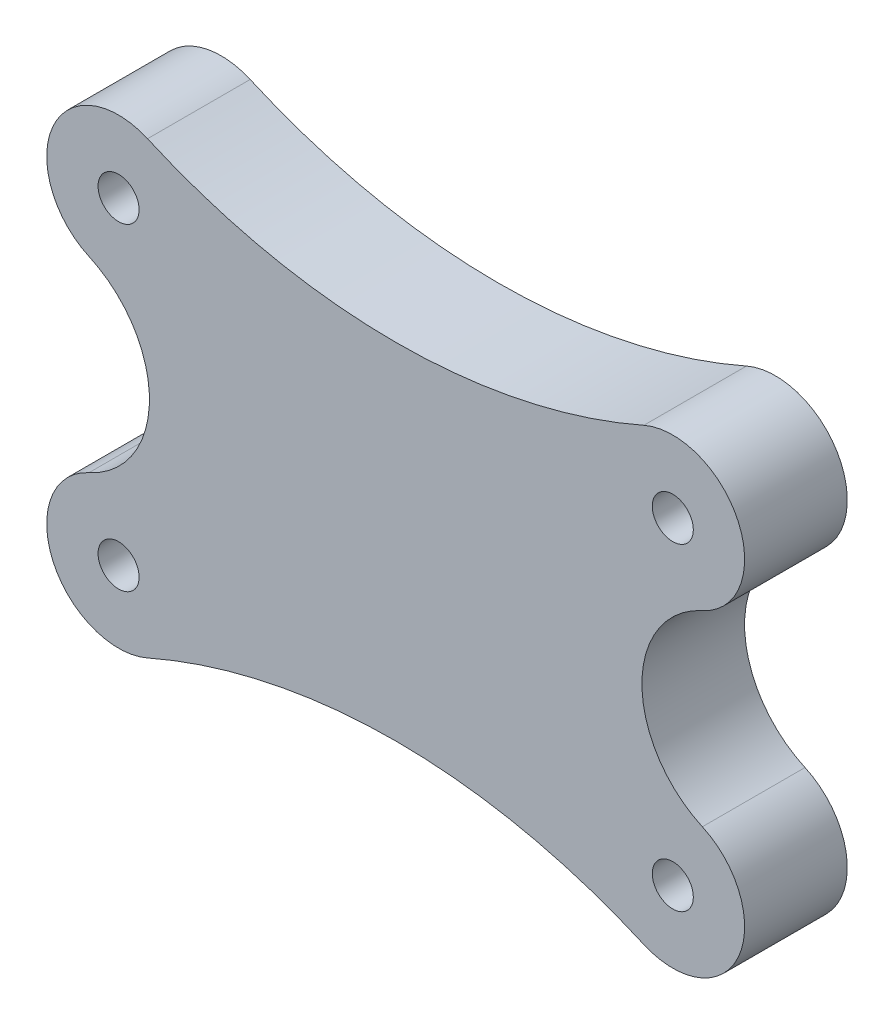
ISO-10303-21;
HEADER;
FILE_DESCRIPTION(('STEP AP214'),'2;1');
FILE_NAME('part.step','',(''),(''),'','','');
FILE_SCHEMA(('AUTOMOTIVE_DESIGN { 1 0 10303 214 1 1 1 1 }'));
ENDSEC;
DATA;
#1=APPLICATION_CONTEXT('core data for automotive mechanical design processes');
#2=APPLICATION_PROTOCOL_DEFINITION('international standard','automotive_design',2000,#1);
#3=PRODUCT_CONTEXT('',#1,'mechanical');
#4=PRODUCT('Part','Part','',(#3));
#5=PRODUCT_RELATED_PRODUCT_CATEGORY('part','',(#4));
#6=PRODUCT_DEFINITION_FORMATION('','',#4);
#7=PRODUCT_DEFINITION_CONTEXT('part definition',#1,'design');
#8=PRODUCT_DEFINITION('design','',#6,#7);
#9=PRODUCT_DEFINITION_SHAPE('','',#8);
#10=(LENGTH_UNIT() NAMED_UNIT(*) SI_UNIT(.MILLI.,.METRE.));
#11=(NAMED_UNIT(*) PLANE_ANGLE_UNIT() SI_UNIT($,.RADIAN.));
#12=(NAMED_UNIT(*) SI_UNIT($,.STERADIAN.) SOLID_ANGLE_UNIT());
#13=UNCERTAINTY_MEASURE_WITH_UNIT(LENGTH_MEASURE(1.E-05),#10,'distance_accuracy_value','');
#14=(GEOMETRIC_REPRESENTATION_CONTEXT(3) GLOBAL_UNCERTAINTY_ASSIGNED_CONTEXT((#13)) GLOBAL_UNIT_ASSIGNED_CONTEXT((#10,
#11,#12)) REPRESENTATION_CONTEXT('',''));
#15=CARTESIAN_POINT('',(0.,0.,0.));
#16=DIRECTION('',(0.,0.,1.));
#17=DIRECTION('',(1.,0.,0.));
#18=AXIS2_PLACEMENT_3D('',#15,#16,#17);
#19=CARTESIAN_POINT('',(0.,0.,5.));
#20=DIRECTION('',(0.,0.,1.));
#21=DIRECTION('',(1.,0.,0.));
#22=AXIS2_PLACEMENT_3D('',#19,#20,#21);
#23=PLANE('',#22);
#24=CARTESIAN_POINT('',(-3.5,3.49999999999999,5.));
#25=DIRECTION('',(0.,0.,1.));
#26=DIRECTION('',(1.,0.,0.));
#27=AXIS2_PLACEMENT_3D('',#24,#25,#26);
#28=CIRCLE('',#27,1.);
#29=CARTESIAN_POINT('',(-2.49999999999999,3.49999999999999,5.));
#30=VERTEX_POINT('',#29);
#31=EDGE_CURVE('E167',#30,#30,#28,.F.);
#32=ORIENTED_EDGE('',*,*,#31,.T.);
#33=EDGE_LOOP('',(#32));
#34=FACE_BOUND('',#33,.T.);
#35=CARTESIAN_POINT('',(-3.5,19.,5.));
#36=DIRECTION('',(0.,0.,1.));
#37=DIRECTION('',(1.,0.,0.));
#38=AXIS2_PLACEMENT_3D('',#35,#36,#37);
#39=CIRCLE('',#38,1.);
#40=CARTESIAN_POINT('',(-2.5,19.,5.));
#41=VERTEX_POINT('',#40);
#42=EDGE_CURVE('E170',#41,#41,#39,.T.);
#43=ORIENTED_EDGE('',*,*,#42,.F.);
#44=EDGE_LOOP('',(#43));
#45=FACE_BOUND('',#44,.T.);
#46=CARTESIAN_POINT('',(-30.5,19.,5.));
#47=DIRECTION('',(0.,0.,1.));
#48=DIRECTION('',(1.,0.,0.));
#49=AXIS2_PLACEMENT_3D('',#46,#47,#48);
#50=CIRCLE('',#49,0.999999999999998);
#51=CARTESIAN_POINT('',(-29.5,19.,5.));
#52=VERTEX_POINT('',#51);
#53=EDGE_CURVE('E174',#52,#52,#50,.T.);
#54=ORIENTED_EDGE('',*,*,#53,.F.);
#55=EDGE_LOOP('',(#54));
#56=FACE_BOUND('',#55,.T.);
#57=CARTESIAN_POINT('',(-30.5,3.49999999999999,5.));
#58=DIRECTION('',(0.,0.,1.));
#59=DIRECTION('',(1.,0.,0.));
#60=AXIS2_PLACEMENT_3D('',#57,#58,#59);
#61=CIRCLE('',#60,0.999999999999998);
#62=CARTESIAN_POINT('',(-29.5,3.49999999999999,5.));
#63=VERTEX_POINT('',#62);
#64=EDGE_CURVE('E112',#63,#63,#61,.F.);
#65=ORIENTED_EDGE('',*,*,#64,.T.);
#66=EDGE_LOOP('',(#65));
#67=FACE_BOUND('',#66,.T.);
#68=CARTESIAN_POINT('',(-30.5,3.49999999999999,5.));
#69=DIRECTION('',(0.,0.,1.));
#70=DIRECTION('',(1.,0.,0.));
#71=AXIS2_PLACEMENT_3D('',#68,#69,#70);
#72=CIRCLE('',#71,3.49999999999999);
#73=CARTESIAN_POINT('',(-31.9405535284927,6.68979709880534,5.));
#74=VERTEX_POINT('',#73);
#75=CARTESIAN_POINT('',(-29.089552238806,0.296777074110705,5.));
#76=VERTEX_POINT('',#75);
#77=EDGE_CURVE('E51',#74,#76,#72,.T.);
#78=ORIENTED_EDGE('',*,*,#77,.T.);
#79=CARTESIAN_POINT('',(-17.,-27.1594194335118,5.));
#80=DIRECTION('',(0.,0.,1.));
#81=DIRECTION('',(1.,0.,0.));
#82=AXIS2_PLACEMENT_3D('',#79,#80,#81);
#83=CIRCLE('',#82,30.);
#84=CARTESIAN_POINT('',(-4.91044776119402,0.296777074110709,5.));
#85=VERTEX_POINT('',#84);
#86=EDGE_CURVE('E164',#76,#85,#83,.F.);
#87=ORIENTED_EDGE('',*,*,#86,.T.);
#88=CARTESIAN_POINT('',(-3.5,3.49999999999999,5.));
#89=DIRECTION('',(0.,0.,1.));
#90=DIRECTION('',(1.,0.,0.));
#91=AXIS2_PLACEMENT_3D('',#88,#89,#90);
#92=CIRCLE('',#91,3.49999999999999);
#93=CARTESIAN_POINT('',(-2.05944647150726,6.68979709880535,5.));
#94=VERTEX_POINT('',#93);
#95=EDGE_CURVE('E59',#85,#94,#92,.T.);
#96=ORIENTED_EDGE('',*,*,#95,.T.);
#97=CARTESIAN_POINT('',(0.,11.25,5.));
#98=DIRECTION('',(0.,0.,1.));
#99=DIRECTION('',(1.,0.,0.));
#100=AXIS2_PLACEMENT_3D('',#97,#98,#99);
#101=CIRCLE('',#100,5.00367567584748);
#102=CARTESIAN_POINT('',(-2.05944647150726,15.8102029011946,5.));
#103=VERTEX_POINT('',#102);
#104=EDGE_CURVE('E160',#94,#103,#101,.F.);
#105=ORIENTED_EDGE('',*,*,#104,.T.);
#106=CARTESIAN_POINT('',(-3.5,19.,5.));
#107=DIRECTION('',(0.,0.,1.));
#108=DIRECTION('',(1.,0.,0.));
#109=AXIS2_PLACEMENT_3D('',#106,#107,#108);
#110=CIRCLE('',#109,3.5);
#111=CARTESIAN_POINT('',(-4.91044776119403,22.2032229258893,5.));
#112=VERTEX_POINT('',#111);
#113=EDGE_CURVE('E158',#103,#112,#110,.T.);
#114=ORIENTED_EDGE('',*,*,#113,.T.);
#115=CARTESIAN_POINT('',(-17.,49.6594194335118,5.));
#116=DIRECTION('',(0.,0.,1.));
#117=DIRECTION('',(1.,0.,0.));
#118=AXIS2_PLACEMENT_3D('',#115,#116,#117);
#119=CIRCLE('',#118,30.);
#120=CARTESIAN_POINT('',(-29.089552238806,22.2032229258893,5.));
#121=VERTEX_POINT('',#120);
#122=EDGE_CURVE('E155',#112,#121,#119,.F.);
#123=ORIENTED_EDGE('',*,*,#122,.T.);
#124=CARTESIAN_POINT('',(-30.5,19.,5.));
#125=DIRECTION('',(0.,0.,1.));
#126=DIRECTION('',(1.,0.,0.));
#127=AXIS2_PLACEMENT_3D('',#124,#125,#126);
#128=CIRCLE('',#127,3.49999999999998);
#129=CARTESIAN_POINT('',(-31.9405535284927,15.8102029011946,5.));
#130=VERTEX_POINT('',#129);
#131=EDGE_CURVE('E152',#121,#130,#128,.T.);
#132=ORIENTED_EDGE('',*,*,#131,.T.);
#133=CARTESIAN_POINT('',(-34.,11.25,5.));
#134=DIRECTION('',(0.,0.,1.));
#135=DIRECTION('',(1.,0.,0.));
#136=AXIS2_PLACEMENT_3D('',#133,#134,#135);
#137=CIRCLE('',#136,5.00367567584749);
#138=EDGE_CURVE('E150',#130,#74,#137,.F.);
#139=ORIENTED_EDGE('',*,*,#138,.T.);
#140=EDGE_LOOP('',(#78,#87,#96,#105,#114,#123,#132,#139));
#141=FACE_BOUND('',#140,.T.);
#142=ADVANCED_FACE('F36',(#34,#45,#56,#67,#141),#23,.T.);
#143=CARTESIAN_POINT('',(0.,0.,0.));
#144=DIRECTION('',(0.,0.,1.));
#145=DIRECTION('',(1.,0.,0.));
#146=AXIS2_PLACEMENT_3D('',#143,#144,#145);
#147=PLANE('',#146);
#148=CARTESIAN_POINT('',(-3.5,3.49999999999999,0.));
#149=DIRECTION('',(0.,0.,1.));
#150=DIRECTION('',(1.,0.,0.));
#151=AXIS2_PLACEMENT_3D('',#148,#149,#150);
#152=CIRCLE('',#151,1.);
#153=CARTESIAN_POINT('',(-2.49999999999999,3.49999999999999,0.));
#154=VERTEX_POINT('',#153);
#155=EDGE_CURVE('E166',#154,#154,#152,.F.);
#156=ORIENTED_EDGE('',*,*,#155,.F.);
#157=EDGE_LOOP('',(#156));
#158=FACE_BOUND('',#157,.T.);
#159=CARTESIAN_POINT('',(-3.5,19.,0.));
#160=DIRECTION('',(0.,0.,1.));
#161=DIRECTION('',(1.,0.,0.));
#162=AXIS2_PLACEMENT_3D('',#159,#160,#161);
#163=CIRCLE('',#162,1.);
#164=CARTESIAN_POINT('',(-2.5,19.,0.));
#165=VERTEX_POINT('',#164);
#166=EDGE_CURVE('E181',#165,#165,#163,.T.);
#167=ORIENTED_EDGE('',*,*,#166,.T.);
#168=EDGE_LOOP('',(#167));
#169=FACE_BOUND('',#168,.T.);
#170=CARTESIAN_POINT('',(-30.5,19.,0.));
#171=DIRECTION('',(0.,0.,1.));
#172=DIRECTION('',(1.,0.,0.));
#173=AXIS2_PLACEMENT_3D('',#170,#171,#172);
#174=CIRCLE('',#173,0.999999999999998);
#175=CARTESIAN_POINT('',(-29.5,19.,0.));
#176=VERTEX_POINT('',#175);
#177=EDGE_CURVE('E184',#176,#176,#174,.T.);
#178=ORIENTED_EDGE('',*,*,#177,.T.);
#179=EDGE_LOOP('',(#178));
#180=FACE_BOUND('',#179,.T.);
#181=CARTESIAN_POINT('',(-30.5,3.49999999999999,0.));
#182=DIRECTION('',(0.,0.,1.));
#183=DIRECTION('',(1.,0.,0.));
#184=AXIS2_PLACEMENT_3D('',#181,#182,#183);
#185=CIRCLE('',#184,0.999999999999998);
#186=CARTESIAN_POINT('',(-29.5,3.49999999999999,0.));
#187=VERTEX_POINT('',#186);
#188=EDGE_CURVE('E171',#187,#187,#185,.F.);
#189=ORIENTED_EDGE('',*,*,#188,.F.);
#190=EDGE_LOOP('',(#189));
#191=FACE_BOUND('',#190,.T.);
#192=CARTESIAN_POINT('',(-17.,-27.1594194335118,0.));
#193=DIRECTION('',(0.,0.,1.));
#194=DIRECTION('',(-1.,0.,0.));
#195=AXIS2_PLACEMENT_3D('',#192,#193,#194);
#196=CIRCLE('',#195,30.);
#197=CARTESIAN_POINT('',(-4.91044776119402,0.296777074110709,0.));
#198=VERTEX_POINT('',#197);
#199=CARTESIAN_POINT('',(-29.089552238806,0.296777074110705,0.));
#200=VERTEX_POINT('',#199);
#201=EDGE_CURVE('E108',#198,#200,#196,.T.);
#202=ORIENTED_EDGE('',*,*,#201,.T.);
#203=CARTESIAN_POINT('',(-30.5,3.49999999999999,0.));
#204=DIRECTION('',(0.,0.,1.));
#205=DIRECTION('',(1.,0.,0.));
#206=AXIS2_PLACEMENT_3D('',#203,#204,#205);
#207=CIRCLE('',#206,3.49999999999999);
#208=CARTESIAN_POINT('',(-31.9405535284927,6.68979709880534,0.));
#209=VERTEX_POINT('',#208);
#210=EDGE_CURVE('E102',#209,#200,#207,.T.);
#211=ORIENTED_EDGE('',*,*,#210,.F.);
#212=CARTESIAN_POINT('',(-34.,11.25,0.));
#213=DIRECTION('',(0.,0.,1.));
#214=DIRECTION('',(-1.,0.,0.));
#215=AXIS2_PLACEMENT_3D('',#212,#213,#214);
#216=CIRCLE('',#215,5.00367567584749);
#217=CARTESIAN_POINT('',(-31.9405535284927,15.8102029011946,0.));
#218=VERTEX_POINT('',#217);
#219=EDGE_CURVE('E106',#209,#218,#216,.T.);
#220=ORIENTED_EDGE('',*,*,#219,.T.);
#221=CARTESIAN_POINT('',(-30.5,19.,0.));
#222=DIRECTION('',(0.,0.,1.));
#223=DIRECTION('',(1.,0.,0.));
#224=AXIS2_PLACEMENT_3D('',#221,#222,#223);
#225=CIRCLE('',#224,3.49999999999998);
#226=CARTESIAN_POINT('',(-29.089552238806,22.2032229258893,0.));
#227=VERTEX_POINT('',#226);
#228=EDGE_CURVE('E111',#227,#218,#225,.T.);
#229=ORIENTED_EDGE('',*,*,#228,.F.);
#230=CARTESIAN_POINT('',(-17.,49.6594194335118,0.));
#231=DIRECTION('',(0.,0.,1.));
#232=DIRECTION('',(1.,0.,0.));
#233=AXIS2_PLACEMENT_3D('',#230,#231,#232);
#234=CIRCLE('',#233,30.);
#235=CARTESIAN_POINT('',(-4.91044776119403,22.2032229258893,0.));
#236=VERTEX_POINT('',#235);
#237=EDGE_CURVE('E124',#227,#236,#234,.T.);
#238=ORIENTED_EDGE('',*,*,#237,.T.);
#239=CARTESIAN_POINT('',(-3.5,19.,0.));
#240=DIRECTION('',(0.,0.,1.));
#241=DIRECTION('',(1.,0.,0.));
#242=AXIS2_PLACEMENT_3D('',#239,#240,#241);
#243=CIRCLE('',#242,3.5);
#244=CARTESIAN_POINT('',(-2.05944647150726,15.8102029011946,0.));
#245=VERTEX_POINT('',#244);
#246=EDGE_CURVE('E44',#245,#236,#243,.T.);
#247=ORIENTED_EDGE('',*,*,#246,.F.);
#248=CARTESIAN_POINT('',(0.,11.25,0.));
#249=DIRECTION('',(0.,0.,1.));
#250=DIRECTION('',(-1.,0.,0.));
#251=AXIS2_PLACEMENT_3D('',#248,#249,#250);
#252=CIRCLE('',#251,5.00367567584748);
#253=CARTESIAN_POINT('',(-2.05944647150726,6.68979709880535,0.));
#254=VERTEX_POINT('',#253);
#255=EDGE_CURVE('E127',#245,#254,#252,.T.);
#256=ORIENTED_EDGE('',*,*,#255,.T.);
#257=CARTESIAN_POINT('',(-3.5,3.49999999999999,0.));
#258=DIRECTION('',(0.,0.,1.));
#259=DIRECTION('',(1.,0.,0.));
#260=AXIS2_PLACEMENT_3D('',#257,#258,#259);
#261=CIRCLE('',#260,3.49999999999999);
#262=EDGE_CURVE('E11',#198,#254,#261,.T.);
#263=ORIENTED_EDGE('',*,*,#262,.F.);
#264=EDGE_LOOP('',(#202,#211,#220,#229,#238,#247,#256,#263));
#265=FACE_BOUND('',#264,.T.);
#266=ADVANCED_FACE('F104',(#158,#169,#180,#191,#265),#147,.F.);
#267=CARTESIAN_POINT('',(-30.5,19.,5.));
#268=DIRECTION('',(0.,0.,-1.));
#269=DIRECTION('',(-1.,0.,0.));
#270=AXIS2_PLACEMENT_3D('',#267,#268,#269);
#271=CYLINDRICAL_SURFACE('',#270,0.999999999999998);
#272=ORIENTED_EDGE('',*,*,#53,.T.);
#273=EDGE_LOOP('',(#272));
#274=FACE_BOUND('',#273,.T.);
#275=ORIENTED_EDGE('',*,*,#177,.F.);
#276=EDGE_LOOP('',(#275));
#277=FACE_BOUND('',#276,.T.);
#278=ADVANCED_FACE('F222',(#274,#277),#271,.F.);
#279=CARTESIAN_POINT('',(-3.5,19.,5.));
#280=DIRECTION('',(0.,0.,-1.));
#281=DIRECTION('',(-1.,0.,0.));
#282=AXIS2_PLACEMENT_3D('',#279,#280,#281);
#283=CYLINDRICAL_SURFACE('',#282,1.);
#284=ORIENTED_EDGE('',*,*,#42,.T.);
#285=EDGE_LOOP('',(#284));
#286=FACE_BOUND('',#285,.T.);
#287=ORIENTED_EDGE('',*,*,#166,.F.);
#288=EDGE_LOOP('',(#287));
#289=FACE_BOUND('',#288,.T.);
#290=ADVANCED_FACE('F232',(#286,#289),#283,.F.);
#291=CARTESIAN_POINT('',(-3.5,3.49999999999999,5.));
#292=DIRECTION('',(0.,0.,-1.));
#293=DIRECTION('',(-1.,0.,0.));
#294=AXIS2_PLACEMENT_3D('',#291,#292,#293);
#295=CYLINDRICAL_SURFACE('',#294,1.);
#296=ORIENTED_EDGE('',*,*,#31,.F.);
#297=EDGE_LOOP('',(#296));
#298=FACE_BOUND('',#297,.T.);
#299=ORIENTED_EDGE('',*,*,#155,.T.);
#300=EDGE_LOOP('',(#299));
#301=FACE_BOUND('',#300,.T.);
#302=ADVANCED_FACE('F38',(#298,#301),#295,.F.);
#303=CARTESIAN_POINT('',(-30.5,3.49999999999999,5.));
#304=DIRECTION('',(0.,0.,-1.));
#305=DIRECTION('',(-1.,0.,0.));
#306=AXIS2_PLACEMENT_3D('',#303,#304,#305);
#307=CYLINDRICAL_SURFACE('',#306,0.999999999999998);
#308=ORIENTED_EDGE('',*,*,#64,.F.);
#309=EDGE_LOOP('',(#308));
#310=FACE_BOUND('',#309,.T.);
#311=ORIENTED_EDGE('',*,*,#188,.T.);
#312=EDGE_LOOP('',(#311));
#313=FACE_BOUND('',#312,.T.);
#314=ADVANCED_FACE('F227',(#310,#313),#307,.F.);
#315=CARTESIAN_POINT('',(-3.5,3.49999999999999,10.));
#316=DIRECTION('',(0.,0.,-1.));
#317=DIRECTION('',(-1.,0.,0.));
#318=AXIS2_PLACEMENT_3D('',#315,#316,#317);
#319=CYLINDRICAL_SURFACE('',#318,3.49999999999999);
#320=ORIENTED_EDGE('',*,*,#95,.F.);
#321=DIRECTION('',(0.,0.,-1.));
#322=VECTOR('',#321,1.);
#323=CARTESIAN_POINT('',(-4.91044776119402,0.296777074110709,10.));
#324=LINE('',#323,#322);
#325=EDGE_CURVE('E133',#85,#198,#324,.T.);
#326=ORIENTED_EDGE('',*,*,#325,.T.);
#327=ORIENTED_EDGE('',*,*,#262,.T.);
#328=DIRECTION('',(0.,0.,-1.));
#329=VECTOR('',#328,1.);
#330=CARTESIAN_POINT('',(-2.05944647150726,6.68979709880535,10.));
#331=LINE('',#330,#329);
#332=EDGE_CURVE('E135',#94,#254,#331,.T.);
#333=ORIENTED_EDGE('',*,*,#332,.F.);
#334=EDGE_LOOP('',(#320,#326,#327,#333));
#335=FACE_BOUND('',#334,.T.);
#336=ADVANCED_FACE('F204',(#335),#319,.T.);
#337=CARTESIAN_POINT('',(-3.5,19.,10.));
#338=DIRECTION('',(0.,0.,-1.));
#339=DIRECTION('',(-1.,0.,0.));
#340=AXIS2_PLACEMENT_3D('',#337,#338,#339);
#341=CYLINDRICAL_SURFACE('',#340,3.5);
#342=ORIENTED_EDGE('',*,*,#113,.F.);
#343=DIRECTION('',(0.,0.,-1.));
#344=VECTOR('',#343,1.);
#345=CARTESIAN_POINT('',(-2.05944647150726,15.8102029011946,10.));
#346=LINE('',#345,#344);
#347=EDGE_CURVE('E138',#103,#245,#346,.T.);
#348=ORIENTED_EDGE('',*,*,#347,.T.);
#349=ORIENTED_EDGE('',*,*,#246,.T.);
#350=DIRECTION('',(0.,0.,-1.));
#351=VECTOR('',#350,1.);
#352=CARTESIAN_POINT('',(-4.91044776119403,22.2032229258893,10.));
#353=LINE('',#352,#351);
#354=EDGE_CURVE('E141',#112,#236,#353,.T.);
#355=ORIENTED_EDGE('',*,*,#354,.F.);
#356=EDGE_LOOP('',(#342,#348,#349,#355));
#357=FACE_BOUND('',#356,.T.);
#358=ADVANCED_FACE('F191',(#357),#341,.T.);
#359=CARTESIAN_POINT('',(-30.5,19.,10.));
#360=DIRECTION('',(0.,0.,-1.));
#361=DIRECTION('',(-1.,0.,0.));
#362=AXIS2_PLACEMENT_3D('',#359,#360,#361);
#363=CYLINDRICAL_SURFACE('',#362,3.49999999999998);
#364=ORIENTED_EDGE('',*,*,#131,.F.);
#365=DIRECTION('',(0.,0.,-1.));
#366=VECTOR('',#365,1.);
#367=CARTESIAN_POINT('',(-29.089552238806,22.2032229258893,10.));
#368=LINE('',#367,#366);
#369=EDGE_CURVE('E144',#121,#227,#368,.T.);
#370=ORIENTED_EDGE('',*,*,#369,.T.);
#371=ORIENTED_EDGE('',*,*,#228,.T.);
#372=DIRECTION('',(0.,0.,-1.));
#373=VECTOR('',#372,1.);
#374=CARTESIAN_POINT('',(-31.9405535284927,15.8102029011946,10.));
#375=LINE('',#374,#373);
#376=EDGE_CURVE('E118',#130,#218,#375,.T.);
#377=ORIENTED_EDGE('',*,*,#376,.F.);
#378=EDGE_LOOP('',(#364,#370,#371,#377));
#379=FACE_BOUND('',#378,.T.);
#380=ADVANCED_FACE('F200',(#379),#363,.T.);
#381=CARTESIAN_POINT('',(-30.5,3.49999999999999,10.));
#382=DIRECTION('',(0.,0.,-1.));
#383=DIRECTION('',(-1.,0.,0.));
#384=AXIS2_PLACEMENT_3D('',#381,#382,#383);
#385=CYLINDRICAL_SURFACE('',#384,3.49999999999999);
#386=ORIENTED_EDGE('',*,*,#77,.F.);
#387=DIRECTION('',(0.,0.,-1.));
#388=VECTOR('',#387,1.);
#389=CARTESIAN_POINT('',(-31.9405535284927,6.68979709880534,10.));
#390=LINE('',#389,#388);
#391=EDGE_CURVE('E115',#74,#209,#390,.T.);
#392=ORIENTED_EDGE('',*,*,#391,.T.);
#393=ORIENTED_EDGE('',*,*,#210,.T.);
#394=DIRECTION('',(0.,0.,-1.));
#395=VECTOR('',#394,1.);
#396=CARTESIAN_POINT('',(-29.089552238806,0.296777074110705,10.));
#397=LINE('',#396,#395);
#398=EDGE_CURVE('E119',#76,#200,#397,.T.);
#399=ORIENTED_EDGE('',*,*,#398,.F.);
#400=EDGE_LOOP('',(#386,#392,#393,#399));
#401=FACE_BOUND('',#400,.T.);
#402=ADVANCED_FACE('F116',(#401),#385,.T.);
#403=CARTESIAN_POINT('',(-17.,-27.1594194335118,10.));
#404=DIRECTION('',(0.,0.,-1.));
#405=DIRECTION('',(-1.,0.,0.));
#406=AXIS2_PLACEMENT_3D('',#403,#404,#405);
#407=CYLINDRICAL_SURFACE('',#406,30.);
#408=ORIENTED_EDGE('',*,*,#398,.T.);
#409=ORIENTED_EDGE('',*,*,#201,.F.);
#410=ORIENTED_EDGE('',*,*,#325,.F.);
#411=ORIENTED_EDGE('',*,*,#86,.F.);
#412=EDGE_LOOP('',(#408,#409,#410,#411));
#413=FACE_BOUND('',#412,.T.);
#414=ADVANCED_FACE('F207',(#413),#407,.F.);
#415=CARTESIAN_POINT('',(0.,11.25,10.));
#416=DIRECTION('',(0.,0.,-1.));
#417=DIRECTION('',(-1.,0.,0.));
#418=AXIS2_PLACEMENT_3D('',#415,#416,#417);
#419=CYLINDRICAL_SURFACE('',#418,5.00367567584748);
#420=ORIENTED_EDGE('',*,*,#332,.T.);
#421=ORIENTED_EDGE('',*,*,#255,.F.);
#422=ORIENTED_EDGE('',*,*,#347,.F.);
#423=ORIENTED_EDGE('',*,*,#104,.F.);
#424=EDGE_LOOP('',(#420,#421,#422,#423));
#425=FACE_BOUND('',#424,.T.);
#426=ADVANCED_FACE('F203',(#425),#419,.F.);
#427=CARTESIAN_POINT('',(-17.,49.6594194335118,10.));
#428=DIRECTION('',(0.,0.,-1.));
#429=DIRECTION('',(-1.,0.,0.));
#430=AXIS2_PLACEMENT_3D('',#427,#428,#429);
#431=CYLINDRICAL_SURFACE('',#430,30.);
#432=ORIENTED_EDGE('',*,*,#354,.T.);
#433=ORIENTED_EDGE('',*,*,#237,.F.);
#434=ORIENTED_EDGE('',*,*,#369,.F.);
#435=ORIENTED_EDGE('',*,*,#122,.F.);
#436=EDGE_LOOP('',(#432,#433,#434,#435));
#437=FACE_BOUND('',#436,.T.);
#438=ADVANCED_FACE('F197',(#437),#431,.F.);
#439=CARTESIAN_POINT('',(-34.,11.25,10.));
#440=DIRECTION('',(0.,0.,-1.));
#441=DIRECTION('',(-1.,0.,0.));
#442=AXIS2_PLACEMENT_3D('',#439,#440,#441);
#443=CYLINDRICAL_SURFACE('',#442,5.00367567584749);
#444=ORIENTED_EDGE('',*,*,#376,.T.);
#445=ORIENTED_EDGE('',*,*,#219,.F.);
#446=ORIENTED_EDGE('',*,*,#391,.F.);
#447=ORIENTED_EDGE('',*,*,#138,.F.);
#448=EDGE_LOOP('',(#444,#445,#446,#447));
#449=FACE_BOUND('',#448,.T.);
#450=ADVANCED_FACE('F122',(#449),#443,.F.);
#451=CLOSED_SHELL('',(#142,#266,#278,#290,#302,#314,#336,#358,#380,#402,#414,#426,#438,#450));
#452=MANIFOLD_SOLID_BREP('B2',#451);
#453=ADVANCED_BREP_SHAPE_REPRESENTATION('',(#18,#452),#14);
#454=SHAPE_DEFINITION_REPRESENTATION(#9,#453);
ENDSEC;
END-ISO-10303-21;
